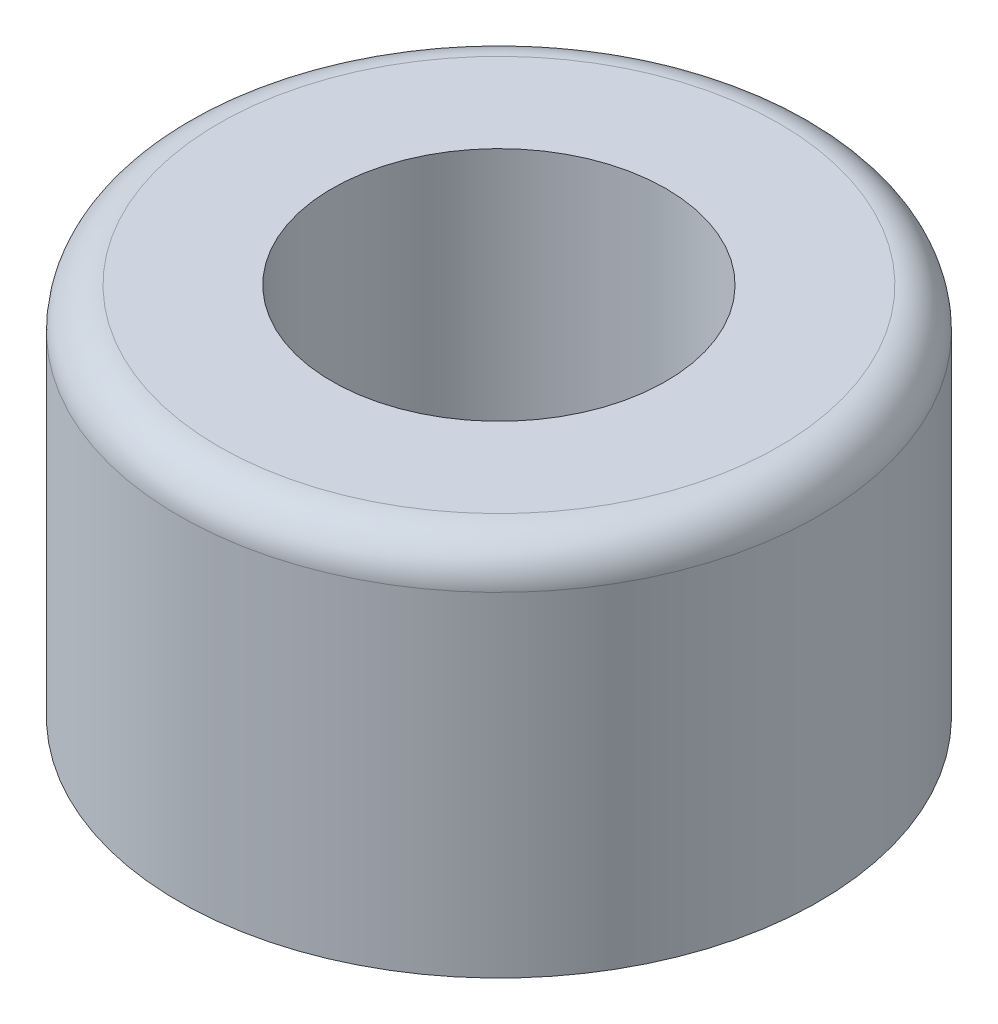
ISO-10303-21;
HEADER;
FILE_DESCRIPTION(('STEP AP214'),'2;1');
FILE_NAME('part.step','',(''),(''),'','','');
FILE_SCHEMA(('AUTOMOTIVE_DESIGN { 1 0 10303 214 1 1 1 1 }'));
ENDSEC;
DATA;
#1=APPLICATION_CONTEXT('core data for automotive mechanical design processes');
#2=APPLICATION_PROTOCOL_DEFINITION('international standard','automotive_design',2000,#1);
#3=PRODUCT_CONTEXT('',#1,'mechanical');
#4=PRODUCT('Part','Part','',(#3));
#5=PRODUCT_RELATED_PRODUCT_CATEGORY('part','',(#4));
#6=PRODUCT_DEFINITION_FORMATION('','',#4);
#7=PRODUCT_DEFINITION_CONTEXT('part definition',#1,'design');
#8=PRODUCT_DEFINITION('design','',#6,#7);
#9=PRODUCT_DEFINITION_SHAPE('','',#8);
#10=(LENGTH_UNIT() NAMED_UNIT(*) SI_UNIT(.MILLI.,.METRE.));
#11=(NAMED_UNIT(*) PLANE_ANGLE_UNIT() SI_UNIT($,.RADIAN.));
#12=(NAMED_UNIT(*) SI_UNIT($,.STERADIAN.) SOLID_ANGLE_UNIT());
#13=UNCERTAINTY_MEASURE_WITH_UNIT(LENGTH_MEASURE(1.E-05),#10,'distance_accuracy_value','');
#14=(GEOMETRIC_REPRESENTATION_CONTEXT(3) GLOBAL_UNCERTAINTY_ASSIGNED_CONTEXT((#13)) GLOBAL_UNIT_ASSIGNED_CONTEXT((#10,
#11,#12)) REPRESENTATION_CONTEXT('',''));
#15=CARTESIAN_POINT('',(0.,0.,0.));
#16=DIRECTION('',(0.,0.,1.));
#17=DIRECTION('',(1.,0.,0.));
#18=AXIS2_PLACEMENT_3D('',#15,#16,#17);
#19=CARTESIAN_POINT('',(0.,2.3749,0.));
#20=DIRECTION('',(0.,1.,0.));
#21=DIRECTION('',(0.,0.,1.));
#22=AXIS2_PLACEMENT_3D('',#19,#20,#21);
#23=PLANE('',#22);
#24=CARTESIAN_POINT('',(0.,2.3749,0.));
#25=DIRECTION('',(0.,-1.,0.));
#26=DIRECTION('',(0.,0.,-1.));
#27=AXIS2_PLACEMENT_3D('',#24,#25,#26);
#28=CIRCLE('',#27,2.1209);
#29=CARTESIAN_POINT('',(0.,2.3749,-2.1209));
#30=VERTEX_POINT('',#29);
#31=EDGE_CURVE('E42',#30,#30,#28,.T.);
#32=ORIENTED_EDGE('',*,*,#31,.T.);
#33=EDGE_LOOP('',(#32));
#34=FACE_BOUND('',#33,.T.);
#35=CARTESIAN_POINT('',(0.,2.3749,0.));
#36=DIRECTION('',(0.,-1.,0.));
#37=DIRECTION('',(0.,0.,-1.));
#38=AXIS2_PLACEMENT_3D('',#35,#36,#37);
#39=CIRCLE('',#38,3.556);
#40=CARTESIAN_POINT('',(0.,2.3749,-3.556));
#41=VERTEX_POINT('',#40);
#42=CARTESIAN_POINT('',(0.,2.3749,3.556));
#43=VERTEX_POINT('',#42);
#44=EDGE_CURVE('E36',#41,#43,#39,.T.);
#45=ORIENTED_EDGE('',*,*,#44,.F.);
#46=CARTESIAN_POINT('',(0.,2.3749,0.));
#47=DIRECTION('',(0.,-1.,0.));
#48=DIRECTION('',(0.,0.,1.));
#49=AXIS2_PLACEMENT_3D('',#46,#47,#48);
#50=CIRCLE('',#49,3.556);
#51=EDGE_CURVE('E40',#43,#41,#50,.T.);
#52=ORIENTED_EDGE('',*,*,#51,.F.);
#53=EDGE_LOOP('',(#45,#52));
#54=FACE_BOUND('',#53,.T.);
#55=ADVANCED_FACE('F18',(#34,#54),#23,.T.);
#56=CARTESIAN_POINT('',(0.,2.3749,0.));
#57=DIRECTION('',(0.,-1.,0.));
#58=DIRECTION('',(0.,0.,-1.));
#59=AXIS2_PLACEMENT_3D('',#56,#57,#58);
#60=CYLINDRICAL_SURFACE('',#59,2.1209);
#61=CARTESIAN_POINT('',(0.,-2.3749,0.));
#62=DIRECTION('',(0.,-1.,0.));
#63=DIRECTION('',(0.,0.,-1.));
#64=AXIS2_PLACEMENT_3D('',#61,#62,#63);
#65=CIRCLE('',#64,2.1209);
#66=CARTESIAN_POINT('',(0.,-2.3749,-2.1209));
#67=VERTEX_POINT('',#66);
#68=EDGE_CURVE('E47',#67,#67,#65,.T.);
#69=ORIENTED_EDGE('',*,*,#68,.T.);
#70=EDGE_LOOP('',(#69));
#71=FACE_BOUND('',#70,.T.);
#72=ORIENTED_EDGE('',*,*,#31,.F.);
#73=EDGE_LOOP('',(#72));
#74=FACE_BOUND('',#73,.T.);
#75=ADVANCED_FACE('F64',(#71,#74),#60,.F.);
#76=CARTESIAN_POINT('',(0.,1.8669,0.));
#77=DIRECTION('',(0.,1.,0.));
#78=DIRECTION('',(0.,0.,1.));
#79=AXIS2_PLACEMENT_3D('',#76,#77,#78);
#80=TOROIDAL_SURFACE('',#79,3.556,0.508);
#81=CARTESIAN_POINT('',(0.,1.8669,0.));
#82=DIRECTION('',(0.,-1.,0.));
#83=DIRECTION('',(0.,0.,-1.));
#84=AXIS2_PLACEMENT_3D('',#81,#82,#83);
#85=CIRCLE('',#84,4.064);
#86=CARTESIAN_POINT('',(0.,1.8669,-4.064));
#87=VERTEX_POINT('',#86);
#88=EDGE_CURVE('E30',#87,#87,#85,.T.);
#89=ORIENTED_EDGE('',*,*,#88,.F.);
#90=EDGE_LOOP('',(#89));
#91=FACE_BOUND('',#90,.T.);
#92=ORIENTED_EDGE('',*,*,#51,.T.);
#93=ORIENTED_EDGE('',*,*,#44,.T.);
#94=EDGE_LOOP('',(#92,#93));
#95=FACE_BOUND('',#94,.T.);
#96=ADVANCED_FACE('F46',(#91,#95),#80,.T.);
#97=CARTESIAN_POINT('',(0.,-2.3749,0.));
#98=DIRECTION('',(0.,1.,0.));
#99=DIRECTION('',(0.,0.,1.));
#100=AXIS2_PLACEMENT_3D('',#97,#98,#99);
#101=PLANE('',#100);
#102=ORIENTED_EDGE('',*,*,#68,.F.);
#103=EDGE_LOOP('',(#102));
#104=FACE_BOUND('',#103,.T.);
#105=CARTESIAN_POINT('',(0.,-2.3749,0.));
#106=DIRECTION('',(0.,-1.,0.));
#107=DIRECTION('',(0.,0.,-1.));
#108=AXIS2_PLACEMENT_3D('',#105,#106,#107);
#109=CIRCLE('',#108,4.064);
#110=CARTESIAN_POINT('',(0.,-2.3749,-4.064));
#111=VERTEX_POINT('',#110);
#112=EDGE_CURVE('E11',#111,#111,#109,.F.);
#113=ORIENTED_EDGE('',*,*,#112,.F.);
#114=EDGE_LOOP('',(#113));
#115=FACE_BOUND('',#114,.T.);
#116=ADVANCED_FACE('F63',(#104,#115),#101,.F.);
#117=CARTESIAN_POINT('',(0.,2.3749,0.));
#118=DIRECTION('',(0.,-1.,0.));
#119=DIRECTION('',(0.,0.,-1.));
#120=AXIS2_PLACEMENT_3D('',#117,#118,#119);
#121=CYLINDRICAL_SURFACE('',#120,4.064);
#122=ORIENTED_EDGE('',*,*,#88,.T.);
#123=EDGE_LOOP('',(#122));
#124=FACE_BOUND('',#123,.T.);
#125=ORIENTED_EDGE('',*,*,#112,.T.);
#126=EDGE_LOOP('',(#125));
#127=FACE_BOUND('',#126,.T.);
#128=ADVANCED_FACE('F86',(#124,#127),#121,.T.);
#129=CLOSED_SHELL('',(#55,#75,#96,#116,#128));
#130=MANIFOLD_SOLID_BREP('B1',#129);
#131=ADVANCED_BREP_SHAPE_REPRESENTATION('',(#18,#130),#14);
#132=SHAPE_DEFINITION_REPRESENTATION(#9,#131);
ENDSEC;
END-ISO-10303-21;
